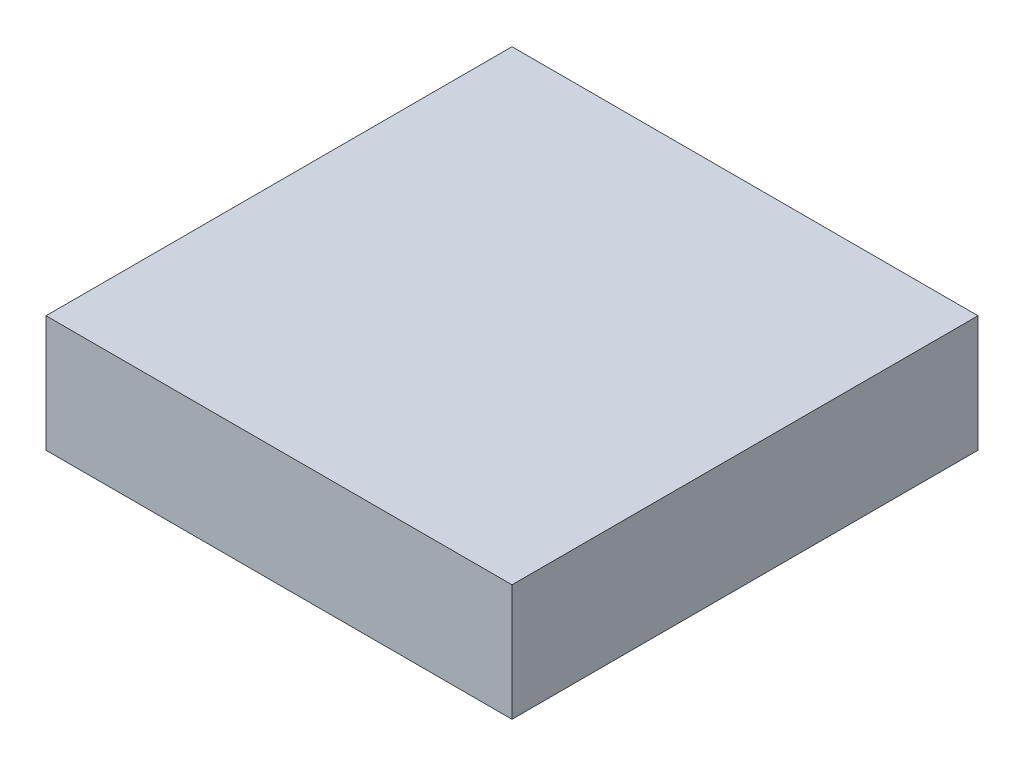
ISO-10303-21;
HEADER;
FILE_DESCRIPTION(('STEP AP214'),'2;1');
FILE_NAME('part.step','',(''),(''),'','','');
FILE_SCHEMA(('AUTOMOTIVE_DESIGN { 1 0 10303 214 1 1 1 1 }'));
ENDSEC;
DATA;
#1=APPLICATION_CONTEXT('core data for automotive mechanical design processes');
#2=APPLICATION_PROTOCOL_DEFINITION('international standard','automotive_design',2000,#1);
#3=PRODUCT_CONTEXT('',#1,'mechanical');
#4=PRODUCT('Part','Part','',(#3));
#5=PRODUCT_RELATED_PRODUCT_CATEGORY('part','',(#4));
#6=PRODUCT_DEFINITION_FORMATION('','',#4);
#7=PRODUCT_DEFINITION_CONTEXT('part definition',#1,'design');
#8=PRODUCT_DEFINITION('design','',#6,#7);
#9=PRODUCT_DEFINITION_SHAPE('','',#8);
#10=(LENGTH_UNIT() NAMED_UNIT(*) SI_UNIT(.MILLI.,.METRE.));
#11=(NAMED_UNIT(*) PLANE_ANGLE_UNIT() SI_UNIT($,.RADIAN.));
#12=(NAMED_UNIT(*) SI_UNIT($,.STERADIAN.) SOLID_ANGLE_UNIT());
#13=UNCERTAINTY_MEASURE_WITH_UNIT(LENGTH_MEASURE(1.E-05),#10,'distance_accuracy_value','');
#14=(GEOMETRIC_REPRESENTATION_CONTEXT(3) GLOBAL_UNCERTAINTY_ASSIGNED_CONTEXT((#13)) GLOBAL_UNIT_ASSIGNED_CONTEXT((#10,
#11,#12)) REPRESENTATION_CONTEXT('',''));
#15=CARTESIAN_POINT('',(0.,0.,0.));
#16=DIRECTION('',(0.,0.,1.));
#17=DIRECTION('',(1.,0.,0.));
#18=AXIS2_PLACEMENT_3D('',#15,#16,#17);
#19=CARTESIAN_POINT('',(0.1999996,-0.04999989999999,0.));
#20=DIRECTION('',(0.,-1.,0.));
#21=DIRECTION('',(0.,0.,-1.));
#22=AXIS2_PLACEMENT_3D('',#19,#20,#21);
#23=PLANE('',#22);
#24=DIRECTION('',(0.,0.,1.));
#25=VECTOR('',#24,1.);
#26=CARTESIAN_POINT('',(-0.1999996,-0.04999989999999,0.));
#27=LINE('',#26,#25);
#28=CARTESIAN_POINT('',(-0.1999996,-0.04999989999999,0.));
#29=VERTEX_POINT('',#28);
#30=CARTESIAN_POINT('',(-0.1999996,-0.04999989999999,0.3999992));
#31=VERTEX_POINT('',#30);
#32=EDGE_CURVE('E20',#29,#31,#27,.T.);
#33=ORIENTED_EDGE('',*,*,#32,.F.);
#34=DIRECTION('',(1.,0.,0.));
#35=VECTOR('',#34,1.);
#36=CARTESIAN_POINT('',(-0.1999996,-0.04999989999999,0.));
#37=LINE('',#36,#35);
#38=CARTESIAN_POINT('',(0.1999996,-0.04999989999999,0.));
#39=VERTEX_POINT('',#38);
#40=EDGE_CURVE('E80',#29,#39,#37,.T.);
#41=ORIENTED_EDGE('',*,*,#40,.T.);
#42=DIRECTION('',(0.,0.,-1.));
#43=VECTOR('',#42,1.);
#44=CARTESIAN_POINT('',(0.1999996,-0.04999989999999,0.));
#45=LINE('',#44,#43);
#46=CARTESIAN_POINT('',(0.1999996,-0.04999989999999,0.3999992));
#47=VERTEX_POINT('',#46);
#48=EDGE_CURVE('E68',#47,#39,#45,.T.);
#49=ORIENTED_EDGE('',*,*,#48,.F.);
#50=DIRECTION('',(1.,0.,0.));
#51=VECTOR('',#50,1.);
#52=CARTESIAN_POINT('',(-0.1999996,-0.04999989999999,0.3999992));
#53=LINE('',#52,#51);
#54=EDGE_CURVE('E56',#31,#47,#53,.T.);
#55=ORIENTED_EDGE('',*,*,#54,.F.);
#56=EDGE_LOOP('',(#33,#41,#49,#55));
#57=FACE_BOUND('',#56,.T.);
#58=ADVANCED_FACE('F17',(#57),#23,.T.);
#59=CARTESIAN_POINT('',(-0.1999996,-0.04999989999999,0.));
#60=DIRECTION('',(-1.,0.,0.));
#61=DIRECTION('',(0.,0.,1.));
#62=AXIS2_PLACEMENT_3D('',#59,#60,#61);
#63=PLANE('',#62);
#64=DIRECTION('',(0.,0.,1.));
#65=VECTOR('',#64,1.);
#66=CARTESIAN_POINT('',(-0.1999996,0.04999989999999,0.));
#67=LINE('',#66,#65);
#68=CARTESIAN_POINT('',(-0.1999996,0.04999989999999,0.));
#69=VERTEX_POINT('',#68);
#70=CARTESIAN_POINT('',(-0.1999996,0.04999989999999,0.3999992));
#71=VERTEX_POINT('',#70);
#72=EDGE_CURVE('E83',#69,#71,#67,.T.);
#73=ORIENTED_EDGE('',*,*,#72,.F.);
#74=DIRECTION('',(0.,1.,0.));
#75=VECTOR('',#74,1.);
#76=CARTESIAN_POINT('',(-0.1999996,0.04999989999999,0.));
#77=LINE('',#76,#75);
#78=EDGE_CURVE('E65',#69,#29,#77,.F.);
#79=ORIENTED_EDGE('',*,*,#78,.T.);
#80=ORIENTED_EDGE('',*,*,#32,.T.);
#81=DIRECTION('',(0.,1.,0.));
#82=VECTOR('',#81,1.);
#83=CARTESIAN_POINT('',(-0.1999996,0.04999989999999,0.3999992));
#84=LINE('',#83,#82);
#85=EDGE_CURVE('E62',#71,#31,#84,.F.);
#86=ORIENTED_EDGE('',*,*,#85,.F.);
#87=EDGE_LOOP('',(#73,#79,#80,#86));
#88=FACE_BOUND('',#87,.T.);
#89=ADVANCED_FACE('F61',(#88),#63,.T.);
#90=CARTESIAN_POINT('',(-0.1999996,0.04999989999999,0.3999992));
#91=DIRECTION('',(0.,0.,1.));
#92=DIRECTION('',(1.,0.,0.));
#93=AXIS2_PLACEMENT_3D('',#90,#91,#92);
#94=PLANE('',#93);
#95=DIRECTION('',(0.,1.,0.));
#96=VECTOR('',#95,1.);
#97=CARTESIAN_POINT('',(0.1999996,0.04999989999999,0.3999992));
#98=LINE('',#97,#96);
#99=CARTESIAN_POINT('',(0.1999996,0.04999989999999,0.3999992));
#100=VERTEX_POINT('',#99);
#101=EDGE_CURVE('E70',#100,#47,#98,.F.);
#102=ORIENTED_EDGE('',*,*,#101,.F.);
#103=DIRECTION('',(1.,0.,0.));
#104=VECTOR('',#103,1.);
#105=CARTESIAN_POINT('',(-0.1999996,0.04999989999999,0.3999992));
#106=LINE('',#105,#104);
#107=EDGE_CURVE('E74',#71,#100,#106,.T.);
#108=ORIENTED_EDGE('',*,*,#107,.F.);
#109=ORIENTED_EDGE('',*,*,#85,.T.);
#110=ORIENTED_EDGE('',*,*,#54,.T.);
#111=EDGE_LOOP('',(#102,#108,#109,#110));
#112=FACE_BOUND('',#111,.T.);
#113=ADVANCED_FACE('F72',(#112),#94,.T.);
#114=CARTESIAN_POINT('',(0.1999996,0.04999989999999,0.));
#115=DIRECTION('',(1.,0.,0.));
#116=DIRECTION('',(0.,0.,-1.));
#117=AXIS2_PLACEMENT_3D('',#114,#115,#116);
#118=PLANE('',#117);
#119=ORIENTED_EDGE('',*,*,#48,.T.);
#120=DIRECTION('',(0.,1.,0.));
#121=VECTOR('',#120,1.);
#122=CARTESIAN_POINT('',(0.1999996,0.04999989999999,0.));
#123=LINE('',#122,#121);
#124=CARTESIAN_POINT('',(0.1999996,0.04999989999999,0.));
#125=VERTEX_POINT('',#124);
#126=EDGE_CURVE('E35',#39,#125,#123,.T.);
#127=ORIENTED_EDGE('',*,*,#126,.T.);
#128=DIRECTION('',(0.,0.,1.));
#129=VECTOR('',#128,1.);
#130=CARTESIAN_POINT('',(0.1999996,0.04999989999999,0.));
#131=LINE('',#130,#129);
#132=EDGE_CURVE('E26',#100,#125,#131,.F.);
#133=ORIENTED_EDGE('',*,*,#132,.F.);
#134=ORIENTED_EDGE('',*,*,#101,.T.);
#135=EDGE_LOOP('',(#119,#127,#133,#134));
#136=FACE_BOUND('',#135,.T.);
#137=ADVANCED_FACE('F89',(#136),#118,.T.);
#138=CARTESIAN_POINT('',(-0.1999996,0.04999989999999,0.));
#139=DIRECTION('',(0.,0.,1.));
#140=DIRECTION('',(1.,0.,0.));
#141=AXIS2_PLACEMENT_3D('',#138,#139,#140);
#142=PLANE('',#141);
#143=ORIENTED_EDGE('',*,*,#126,.F.);
#144=ORIENTED_EDGE('',*,*,#40,.F.);
#145=ORIENTED_EDGE('',*,*,#78,.F.);
#146=DIRECTION('',(1.,0.,0.));
#147=VECTOR('',#146,1.);
#148=CARTESIAN_POINT('',(-0.1999996,0.04999989999999,0.));
#149=LINE('',#148,#147);
#150=EDGE_CURVE('E11',#125,#69,#149,.F.);
#151=ORIENTED_EDGE('',*,*,#150,.F.);
#152=EDGE_LOOP('',(#143,#144,#145,#151));
#153=FACE_BOUND('',#152,.T.);
#154=ADVANCED_FACE('F91',(#153),#142,.F.);
#155=CARTESIAN_POINT('',(-0.1999996,0.04999989999999,0.));
#156=DIRECTION('',(0.,1.,0.));
#157=DIRECTION('',(0.,0.,1.));
#158=AXIS2_PLACEMENT_3D('',#155,#156,#157);
#159=PLANE('',#158);
#160=ORIENTED_EDGE('',*,*,#132,.T.);
#161=ORIENTED_EDGE('',*,*,#150,.T.);
#162=ORIENTED_EDGE('',*,*,#72,.T.);
#163=ORIENTED_EDGE('',*,*,#107,.T.);
#164=EDGE_LOOP('',(#160,#161,#162,#163));
#165=FACE_BOUND('',#164,.T.);
#166=ADVANCED_FACE('F88',(#165),#159,.T.);
#167=CLOSED_SHELL('',(#58,#89,#113,#137,#154,#166));
#168=MANIFOLD_SOLID_BREP('B1',#167);
#169=ADVANCED_BREP_SHAPE_REPRESENTATION('',(#18,#168),#14);
#170=SHAPE_DEFINITION_REPRESENTATION(#9,#169);
ENDSEC;
END-ISO-10303-21;
